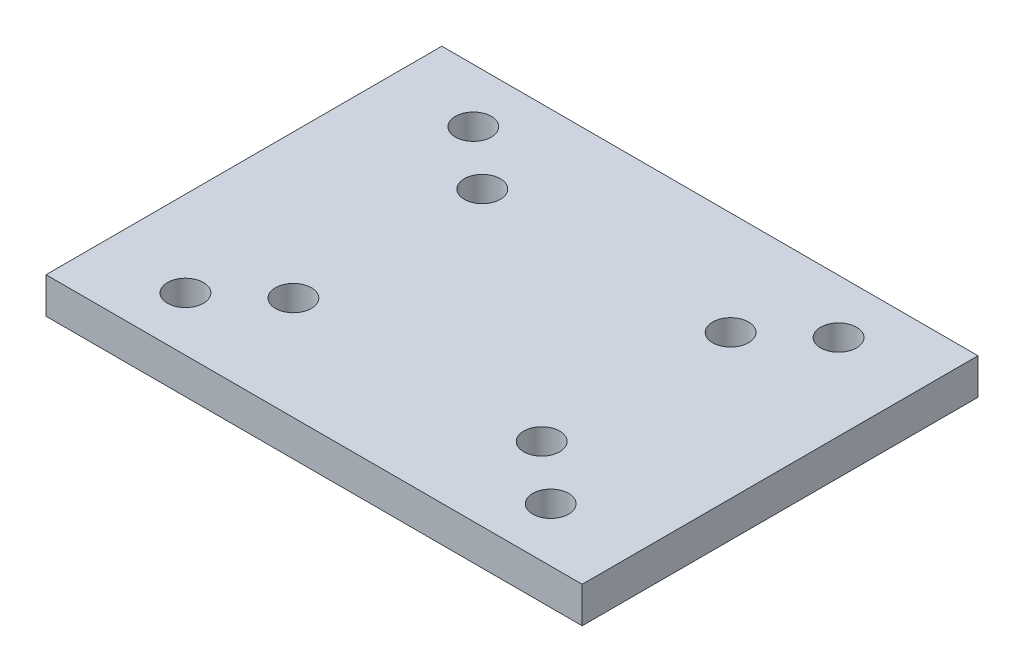
ISO-10303-21;
HEADER;
FILE_DESCRIPTION(('STEP AP214'),'2;1');
FILE_NAME('part.step','',(''),(''),'','','');
FILE_SCHEMA(('AUTOMOTIVE_DESIGN { 1 0 10303 214 1 1 1 1 }'));
ENDSEC;
DATA;
#1=APPLICATION_CONTEXT('core data for automotive mechanical design processes');
#2=APPLICATION_PROTOCOL_DEFINITION('international standard','automotive_design',2000,#1);
#3=PRODUCT_CONTEXT('',#1,'mechanical');
#4=PRODUCT('Part','Part','',(#3));
#5=PRODUCT_RELATED_PRODUCT_CATEGORY('part','',(#4));
#6=PRODUCT_DEFINITION_FORMATION('','',#4);
#7=PRODUCT_DEFINITION_CONTEXT('part definition',#1,'design');
#8=PRODUCT_DEFINITION('design','',#6,#7);
#9=PRODUCT_DEFINITION_SHAPE('','',#8);
#10=(LENGTH_UNIT() NAMED_UNIT(*) SI_UNIT(.MILLI.,.METRE.));
#11=(NAMED_UNIT(*) PLANE_ANGLE_UNIT() SI_UNIT($,.RADIAN.));
#12=(NAMED_UNIT(*) SI_UNIT($,.STERADIAN.) SOLID_ANGLE_UNIT());
#13=UNCERTAINTY_MEASURE_WITH_UNIT(LENGTH_MEASURE(1.E-05),#10,'distance_accuracy_value','');
#14=(GEOMETRIC_REPRESENTATION_CONTEXT(3) GLOBAL_UNCERTAINTY_ASSIGNED_CONTEXT((#13)) GLOBAL_UNIT_ASSIGNED_CONTEXT((#10,
#11,#12)) REPRESENTATION_CONTEXT('',''));
#15=CARTESIAN_POINT('',(0.,0.,0.));
#16=DIRECTION('',(0.,0.,1.));
#17=DIRECTION('',(1.,0.,0.));
#18=AXIS2_PLACEMENT_3D('',#15,#16,#17);
#19=CARTESIAN_POINT('',(6.9,10.,5.25));
#20=DIRECTION('',(0.,-1.,0.));
#21=DIRECTION('',(0.,0.,1.));
#22=AXIS2_PLACEMENT_3D('',#19,#20,#21);
#23=CYLINDRICAL_SURFACE('',#22,1.);
#24=CARTESIAN_POINT('',(6.9,0.,5.25));
#25=DIRECTION('',(0.,1.,0.));
#26=DIRECTION('',(0.,0.,1.));
#27=AXIS2_PLACEMENT_3D('',#24,#25,#26);
#28=CIRCLE('',#27,1.);
#29=CARTESIAN_POINT('',(6.9,0.,6.25));
#30=VERTEX_POINT('',#29);
#31=EDGE_CURVE('E41',#30,#30,#28,.T.);
#32=ORIENTED_EDGE('',*,*,#31,.F.);
#33=EDGE_LOOP('',(#32));
#34=FACE_BOUND('',#33,.T.);
#35=CARTESIAN_POINT('',(6.9,2.,5.25));
#36=DIRECTION('',(0.,1.,0.));
#37=DIRECTION('',(0.,0.,1.));
#38=AXIS2_PLACEMENT_3D('',#35,#36,#37);
#39=CIRCLE('',#38,1.);
#40=CARTESIAN_POINT('',(6.9,2.,6.25));
#41=VERTEX_POINT('',#40);
#42=EDGE_CURVE('E11',#41,#41,#39,.T.);
#43=ORIENTED_EDGE('',*,*,#42,.T.);
#44=EDGE_LOOP('',(#43));
#45=FACE_BOUND('',#44,.T.);
#46=ADVANCED_FACE('F33',(#34,#45),#23,.F.);
#47=CARTESIAN_POINT('',(-6.9,10.,5.25));
#48=DIRECTION('',(0.,-1.,0.));
#49=DIRECTION('',(0.,0.,1.));
#50=AXIS2_PLACEMENT_3D('',#47,#48,#49);
#51=CYLINDRICAL_SURFACE('',#50,1.);
#52=CARTESIAN_POINT('',(-6.9,0.,5.25));
#53=DIRECTION('',(0.,1.,0.));
#54=DIRECTION('',(0.,0.,1.));
#55=AXIS2_PLACEMENT_3D('',#52,#53,#54);
#56=CIRCLE('',#55,1.);
#57=CARTESIAN_POINT('',(-6.9,0.,6.25));
#58=VERTEX_POINT('',#57);
#59=EDGE_CURVE('E111',#58,#58,#56,.T.);
#60=ORIENTED_EDGE('',*,*,#59,.F.);
#61=EDGE_LOOP('',(#60));
#62=FACE_BOUND('',#61,.T.);
#63=CARTESIAN_POINT('',(-6.9,2.,5.25));
#64=DIRECTION('',(0.,1.,0.));
#65=DIRECTION('',(0.,0.,1.));
#66=AXIS2_PLACEMENT_3D('',#63,#64,#65);
#67=CIRCLE('',#66,1.);
#68=CARTESIAN_POINT('',(-6.9,2.,6.25));
#69=VERTEX_POINT('',#68);
#70=EDGE_CURVE('E114',#69,#69,#67,.T.);
#71=ORIENTED_EDGE('',*,*,#70,.T.);
#72=EDGE_LOOP('',(#71));
#73=FACE_BOUND('',#72,.T.);
#74=ADVANCED_FACE('F124',(#62,#73),#51,.F.);
#75=CARTESIAN_POINT('',(0.,2.,0.));
#76=DIRECTION('',(0.,-1.,0.));
#77=DIRECTION('',(0.,0.,-1.));
#78=AXIS2_PLACEMENT_3D('',#75,#76,#77);
#79=PLANE('',#78);
#80=ORIENTED_EDGE('',*,*,#42,.F.);
#81=EDGE_LOOP('',(#80));
#82=FACE_BOUND('',#81,.T.);
#83=ORIENTED_EDGE('',*,*,#70,.F.);
#84=EDGE_LOOP('',(#83));
#85=FACE_BOUND('',#84,.T.);
#86=CARTESIAN_POINT('',(-6.9,2.,-5.25));
#87=DIRECTION('',(0.,-1.,0.));
#88=DIRECTION('',(0.,0.,-1.));
#89=AXIS2_PLACEMENT_3D('',#86,#87,#88);
#90=CIRCLE('',#89,1.);
#91=CARTESIAN_POINT('',(-6.9,2.,-6.25));
#92=VERTEX_POINT('',#91);
#93=EDGE_CURVE('E135',#92,#92,#90,.T.);
#94=ORIENTED_EDGE('',*,*,#93,.T.);
#95=EDGE_LOOP('',(#94));
#96=FACE_BOUND('',#95,.T.);
#97=CARTESIAN_POINT('',(6.9,2.,-5.25));
#98=DIRECTION('',(0.,-1.,0.));
#99=DIRECTION('',(0.,0.,-1.));
#100=AXIS2_PLACEMENT_3D('',#97,#98,#99);
#101=CIRCLE('',#100,1.);
#102=CARTESIAN_POINT('',(6.9,2.,-6.25));
#103=VERTEX_POINT('',#102);
#104=EDGE_CURVE('E138',#103,#103,#101,.T.);
#105=ORIENTED_EDGE('',*,*,#104,.T.);
#106=EDGE_LOOP('',(#105));
#107=FACE_BOUND('',#106,.T.);
#108=DIRECTION('',(0.,0.,-1.));
#109=VECTOR('',#108,1.);
#110=CARTESIAN_POINT('',(14.9,2.,11.));
#111=LINE('',#110,#109);
#112=CARTESIAN_POINT('',(14.9,2.,11.));
#113=VERTEX_POINT('',#112);
#114=CARTESIAN_POINT('',(14.9,2.,-11.));
#115=VERTEX_POINT('',#114);
#116=EDGE_CURVE('E86',#113,#115,#111,.T.);
#117=ORIENTED_EDGE('',*,*,#116,.T.);
#118=DIRECTION('',(-1.,0.,0.));
#119=VECTOR('',#118,1.);
#120=CARTESIAN_POINT('',(-14.9,2.,-11.));
#121=LINE('',#120,#119);
#122=CARTESIAN_POINT('',(-14.9,2.,-11.));
#123=VERTEX_POINT('',#122);
#124=EDGE_CURVE('E80',#115,#123,#121,.T.);
#125=ORIENTED_EDGE('',*,*,#124,.T.);
#126=DIRECTION('',(0.,0.,1.));
#127=VECTOR('',#126,1.);
#128=CARTESIAN_POINT('',(-14.9,2.,11.));
#129=LINE('',#128,#127);
#130=CARTESIAN_POINT('',(-14.9,2.,11.));
#131=VERTEX_POINT('',#130);
#132=EDGE_CURVE('E84',#123,#131,#129,.T.);
#133=ORIENTED_EDGE('',*,*,#132,.T.);
#134=DIRECTION('',(1.,0.,0.));
#135=VECTOR('',#134,1.);
#136=CARTESIAN_POINT('',(-14.9,2.,11.));
#137=LINE('',#136,#135);
#138=EDGE_CURVE('E49',#131,#113,#137,.T.);
#139=ORIENTED_EDGE('',*,*,#138,.T.);
#140=EDGE_LOOP('',(#117,#125,#133,#139));
#141=FACE_BOUND('',#140,.T.);
#142=CARTESIAN_POINT('',(10.15,2.,-8.));
#143=DIRECTION('',(0.,1.,0.));
#144=DIRECTION('',(0.,0.,1.));
#145=AXIS2_PLACEMENT_3D('',#142,#143,#144);
#146=CIRCLE('',#145,1.);
#147=CARTESIAN_POINT('',(10.15,2.,-7.));
#148=VERTEX_POINT('',#147);
#149=EDGE_CURVE('E104',#148,#148,#146,.T.);
#150=ORIENTED_EDGE('',*,*,#149,.F.);
#151=EDGE_LOOP('',(#150));
#152=FACE_BOUND('',#151,.T.);
#153=CARTESIAN_POINT('',(10.15,2.,8.));
#154=DIRECTION('',(0.,1.,0.));
#155=DIRECTION('',(0.,0.,1.));
#156=AXIS2_PLACEMENT_3D('',#153,#154,#155);
#157=CIRCLE('',#156,1.);
#158=CARTESIAN_POINT('',(10.15,2.,9.));
#159=VERTEX_POINT('',#158);
#160=EDGE_CURVE('E159',#159,#159,#157,.T.);
#161=ORIENTED_EDGE('',*,*,#160,.F.);
#162=EDGE_LOOP('',(#161));
#163=FACE_BOUND('',#162,.T.);
#164=CARTESIAN_POINT('',(-10.15,2.,8.));
#165=DIRECTION('',(0.,1.,0.));
#166=DIRECTION('',(0.,0.,1.));
#167=AXIS2_PLACEMENT_3D('',#164,#165,#166);
#168=CIRCLE('',#167,1.);
#169=CARTESIAN_POINT('',(-10.15,2.,9.));
#170=VERTEX_POINT('',#169);
#171=EDGE_CURVE('E153',#170,#170,#168,.T.);
#172=ORIENTED_EDGE('',*,*,#171,.F.);
#173=EDGE_LOOP('',(#172));
#174=FACE_BOUND('',#173,.T.);
#175=CARTESIAN_POINT('',(-10.15,2.,-8.));
#176=DIRECTION('',(0.,1.,0.));
#177=DIRECTION('',(0.,0.,1.));
#178=AXIS2_PLACEMENT_3D('',#175,#176,#177);
#179=CIRCLE('',#178,1.);
#180=CARTESIAN_POINT('',(-10.15,2.,-7.));
#181=VERTEX_POINT('',#180);
#182=EDGE_CURVE('E144',#181,#181,#179,.T.);
#183=ORIENTED_EDGE('',*,*,#182,.F.);
#184=EDGE_LOOP('',(#183));
#185=FACE_BOUND('',#184,.T.);
#186=ADVANCED_FACE('F81',(#82,#85,#96,#107,#141,#152,#163,#174,#185),#79,.F.);
#187=CARTESIAN_POINT('',(0.,0.,0.));
#188=DIRECTION('',(0.,-1.,0.));
#189=DIRECTION('',(0.,0.,-1.));
#190=AXIS2_PLACEMENT_3D('',#187,#188,#189);
#191=PLANE('',#190);
#192=ORIENTED_EDGE('',*,*,#31,.T.);
#193=EDGE_LOOP('',(#192));
#194=FACE_BOUND('',#193,.T.);
#195=ORIENTED_EDGE('',*,*,#59,.T.);
#196=EDGE_LOOP('',(#195));
#197=FACE_BOUND('',#196,.T.);
#198=CARTESIAN_POINT('',(-6.9,0.,-5.25));
#199=DIRECTION('',(0.,-1.,0.));
#200=DIRECTION('',(0.,0.,-1.));
#201=AXIS2_PLACEMENT_3D('',#198,#199,#200);
#202=CIRCLE('',#201,1.);
#203=CARTESIAN_POINT('',(-6.9,0.,-6.25));
#204=VERTEX_POINT('',#203);
#205=EDGE_CURVE('E207',#204,#204,#202,.T.);
#206=ORIENTED_EDGE('',*,*,#205,.F.);
#207=EDGE_LOOP('',(#206));
#208=FACE_BOUND('',#207,.T.);
#209=CARTESIAN_POINT('',(6.9,0.,-5.25));
#210=DIRECTION('',(0.,-1.,0.));
#211=DIRECTION('',(0.,0.,-1.));
#212=AXIS2_PLACEMENT_3D('',#209,#210,#211);
#213=CIRCLE('',#212,1.);
#214=CARTESIAN_POINT('',(6.9,0.,-6.25));
#215=VERTEX_POINT('',#214);
#216=EDGE_CURVE('E141',#215,#215,#213,.T.);
#217=ORIENTED_EDGE('',*,*,#216,.F.);
#218=EDGE_LOOP('',(#217));
#219=FACE_BOUND('',#218,.T.);
#220=CARTESIAN_POINT('',(-10.15,0.,8.));
#221=DIRECTION('',(0.,1.,0.));
#222=DIRECTION('',(0.,0.,1.));
#223=AXIS2_PLACEMENT_3D('',#220,#221,#222);
#224=CIRCLE('',#223,1.);
#225=CARTESIAN_POINT('',(-10.15,0.,9.));
#226=VERTEX_POINT('',#225);
#227=EDGE_CURVE('E151',#226,#226,#224,.T.);
#228=ORIENTED_EDGE('',*,*,#227,.T.);
#229=EDGE_LOOP('',(#228));
#230=FACE_BOUND('',#229,.T.);
#231=CARTESIAN_POINT('',(10.15,0.,-8.));
#232=DIRECTION('',(0.,1.,0.));
#233=DIRECTION('',(0.,0.,1.));
#234=AXIS2_PLACEMENT_3D('',#231,#232,#233);
#235=CIRCLE('',#234,1.);
#236=CARTESIAN_POINT('',(10.15,0.,-7.));
#237=VERTEX_POINT('',#236);
#238=EDGE_CURVE('E162',#237,#237,#235,.T.);
#239=ORIENTED_EDGE('',*,*,#238,.T.);
#240=EDGE_LOOP('',(#239));
#241=FACE_BOUND('',#240,.T.);
#242=DIRECTION('',(0.,0.,-1.));
#243=VECTOR('',#242,1.);
#244=CARTESIAN_POINT('',(14.9,0.,11.));
#245=LINE('',#244,#243);
#246=CARTESIAN_POINT('',(14.9,0.,11.));
#247=VERTEX_POINT('',#246);
#248=CARTESIAN_POINT('',(14.9,0.,-11.));
#249=VERTEX_POINT('',#248);
#250=EDGE_CURVE('E101',#247,#249,#245,.T.);
#251=ORIENTED_EDGE('',*,*,#250,.F.);
#252=DIRECTION('',(1.,0.,0.));
#253=VECTOR('',#252,1.);
#254=CARTESIAN_POINT('',(-14.9,0.,11.));
#255=LINE('',#254,#253);
#256=CARTESIAN_POINT('',(-14.9,0.,11.));
#257=VERTEX_POINT('',#256);
#258=EDGE_CURVE('E72',#257,#247,#255,.T.);
#259=ORIENTED_EDGE('',*,*,#258,.F.);
#260=DIRECTION('',(0.,0.,1.));
#261=VECTOR('',#260,1.);
#262=CARTESIAN_POINT('',(-14.9,0.,11.));
#263=LINE('',#262,#261);
#264=CARTESIAN_POINT('',(-14.9,0.,-11.));
#265=VERTEX_POINT('',#264);
#266=EDGE_CURVE('E66',#265,#257,#263,.T.);
#267=ORIENTED_EDGE('',*,*,#266,.F.);
#268=DIRECTION('',(-1.,0.,0.));
#269=VECTOR('',#268,1.);
#270=CARTESIAN_POINT('',(-14.9,0.,-11.));
#271=LINE('',#270,#269);
#272=EDGE_CURVE('E91',#249,#265,#271,.T.);
#273=ORIENTED_EDGE('',*,*,#272,.F.);
#274=EDGE_LOOP('',(#251,#259,#267,#273));
#275=FACE_BOUND('',#274,.T.);
#276=CARTESIAN_POINT('',(10.15,0.,8.));
#277=DIRECTION('',(0.,1.,0.));
#278=DIRECTION('',(0.,0.,1.));
#279=AXIS2_PLACEMENT_3D('',#276,#277,#278);
#280=CIRCLE('',#279,1.);
#281=CARTESIAN_POINT('',(10.15,0.,9.));
#282=VERTEX_POINT('',#281);
#283=EDGE_CURVE('E156',#282,#282,#280,.T.);
#284=ORIENTED_EDGE('',*,*,#283,.T.);
#285=EDGE_LOOP('',(#284));
#286=FACE_BOUND('',#285,.T.);
#287=CARTESIAN_POINT('',(-10.15,0.,-8.));
#288=DIRECTION('',(0.,1.,0.));
#289=DIRECTION('',(0.,0.,1.));
#290=AXIS2_PLACEMENT_3D('',#287,#288,#289);
#291=CIRCLE('',#290,1.);
#292=CARTESIAN_POINT('',(-10.15,0.,-7.));
#293=VERTEX_POINT('',#292);
#294=EDGE_CURVE('E140',#293,#293,#291,.T.);
#295=ORIENTED_EDGE('',*,*,#294,.T.);
#296=EDGE_LOOP('',(#295));
#297=FACE_BOUND('',#296,.T.);
#298=ADVANCED_FACE('F119',(#194,#197,#208,#219,#230,#241,#275,#286,#297),#191,.T.);
#299=CARTESIAN_POINT('',(14.9,2.,11.));
#300=DIRECTION('',(-1.,0.,0.));
#301=DIRECTION('',(0.,0.,1.));
#302=AXIS2_PLACEMENT_3D('',#299,#300,#301);
#303=PLANE('',#302);
#304=ORIENTED_EDGE('',*,*,#250,.T.);
#305=DIRECTION('',(0.,-1.,0.));
#306=VECTOR('',#305,1.);
#307=CARTESIAN_POINT('',(14.9,2.,-11.));
#308=LINE('',#307,#306);
#309=EDGE_CURVE('E92',#115,#249,#308,.T.);
#310=ORIENTED_EDGE('',*,*,#309,.F.);
#311=ORIENTED_EDGE('',*,*,#116,.F.);
#312=DIRECTION('',(0.,-1.,0.));
#313=VECTOR('',#312,1.);
#314=CARTESIAN_POINT('',(14.9,2.,11.));
#315=LINE('',#314,#313);
#316=EDGE_CURVE('E97',#113,#247,#315,.T.);
#317=ORIENTED_EDGE('',*,*,#316,.T.);
#318=EDGE_LOOP('',(#304,#310,#311,#317));
#319=FACE_BOUND('',#318,.T.);
#320=ADVANCED_FACE('F189',(#319),#303,.F.);
#321=CARTESIAN_POINT('',(-14.9,2.,-11.));
#322=DIRECTION('',(0.,0.,1.));
#323=DIRECTION('',(1.,0.,0.));
#324=AXIS2_PLACEMENT_3D('',#321,#322,#323);
#325=PLANE('',#324);
#326=ORIENTED_EDGE('',*,*,#272,.T.);
#327=DIRECTION('',(0.,-1.,0.));
#328=VECTOR('',#327,1.);
#329=CARTESIAN_POINT('',(-14.9,2.,-11.));
#330=LINE('',#329,#328);
#331=EDGE_CURVE('E89',#123,#265,#330,.T.);
#332=ORIENTED_EDGE('',*,*,#331,.F.);
#333=ORIENTED_EDGE('',*,*,#124,.F.);
#334=ORIENTED_EDGE('',*,*,#309,.T.);
#335=EDGE_LOOP('',(#326,#332,#333,#334));
#336=FACE_BOUND('',#335,.T.);
#337=ADVANCED_FACE('F90',(#336),#325,.F.);
#338=CARTESIAN_POINT('',(-14.9,2.,11.));
#339=DIRECTION('',(1.,0.,0.));
#340=DIRECTION('',(0.,0.,-1.));
#341=AXIS2_PLACEMENT_3D('',#338,#339,#340);
#342=PLANE('',#341);
#343=ORIENTED_EDGE('',*,*,#266,.T.);
#344=DIRECTION('',(0.,-1.,0.));
#345=VECTOR('',#344,1.);
#346=CARTESIAN_POINT('',(-14.9,2.,11.));
#347=LINE('',#346,#345);
#348=EDGE_CURVE('E93',#131,#257,#347,.T.);
#349=ORIENTED_EDGE('',*,*,#348,.F.);
#350=ORIENTED_EDGE('',*,*,#132,.F.);
#351=ORIENTED_EDGE('',*,*,#331,.T.);
#352=EDGE_LOOP('',(#343,#349,#350,#351));
#353=FACE_BOUND('',#352,.T.);
#354=ADVANCED_FACE('F95',(#353),#342,.F.);
#355=CARTESIAN_POINT('',(-14.9,2.,11.));
#356=DIRECTION('',(0.,0.,-1.));
#357=DIRECTION('',(-1.,0.,0.));
#358=AXIS2_PLACEMENT_3D('',#355,#356,#357);
#359=PLANE('',#358);
#360=ORIENTED_EDGE('',*,*,#258,.T.);
#361=ORIENTED_EDGE('',*,*,#316,.F.);
#362=ORIENTED_EDGE('',*,*,#138,.F.);
#363=ORIENTED_EDGE('',*,*,#348,.T.);
#364=EDGE_LOOP('',(#360,#361,#362,#363));
#365=FACE_BOUND('',#364,.T.);
#366=ADVANCED_FACE('F175',(#365),#359,.F.);
#367=CARTESIAN_POINT('',(10.15,2.,-8.));
#368=DIRECTION('',(0.,-1.,0.));
#369=DIRECTION('',(0.,0.,-1.));
#370=AXIS2_PLACEMENT_3D('',#367,#368,#369);
#371=CYLINDRICAL_SURFACE('',#370,1.);
#372=ORIENTED_EDGE('',*,*,#149,.T.);
#373=EDGE_LOOP('',(#372));
#374=FACE_BOUND('',#373,.T.);
#375=ORIENTED_EDGE('',*,*,#238,.F.);
#376=EDGE_LOOP('',(#375));
#377=FACE_BOUND('',#376,.T.);
#378=ADVANCED_FACE('F172',(#374,#377),#371,.F.);
#379=CARTESIAN_POINT('',(10.15,2.,8.));
#380=DIRECTION('',(0.,-1.,0.));
#381=DIRECTION('',(0.,0.,-1.));
#382=AXIS2_PLACEMENT_3D('',#379,#380,#381);
#383=CYLINDRICAL_SURFACE('',#382,1.);
#384=ORIENTED_EDGE('',*,*,#160,.T.);
#385=EDGE_LOOP('',(#384));
#386=FACE_BOUND('',#385,.T.);
#387=ORIENTED_EDGE('',*,*,#283,.F.);
#388=EDGE_LOOP('',(#387));
#389=FACE_BOUND('',#388,.T.);
#390=ADVANCED_FACE('F174',(#386,#389),#383,.F.);
#391=CARTESIAN_POINT('',(-10.15,2.,8.));
#392=DIRECTION('',(0.,-1.,0.));
#393=DIRECTION('',(0.,0.,-1.));
#394=AXIS2_PLACEMENT_3D('',#391,#392,#393);
#395=CYLINDRICAL_SURFACE('',#394,1.);
#396=ORIENTED_EDGE('',*,*,#171,.T.);
#397=EDGE_LOOP('',(#396));
#398=FACE_BOUND('',#397,.T.);
#399=ORIENTED_EDGE('',*,*,#227,.F.);
#400=EDGE_LOOP('',(#399));
#401=FACE_BOUND('',#400,.T.);
#402=ADVANCED_FACE('F182',(#398,#401),#395,.F.);
#403=CARTESIAN_POINT('',(-10.15,2.,-8.));
#404=DIRECTION('',(0.,-1.,0.));
#405=DIRECTION('',(0.,0.,-1.));
#406=AXIS2_PLACEMENT_3D('',#403,#404,#405);
#407=CYLINDRICAL_SURFACE('',#406,1.);
#408=ORIENTED_EDGE('',*,*,#182,.T.);
#409=EDGE_LOOP('',(#408));
#410=FACE_BOUND('',#409,.T.);
#411=ORIENTED_EDGE('',*,*,#294,.F.);
#412=EDGE_LOOP('',(#411));
#413=FACE_BOUND('',#412,.T.);
#414=ADVANCED_FACE('F213',(#410,#413),#407,.F.);
#415=CARTESIAN_POINT('',(6.9,10.,-5.25));
#416=DIRECTION('',(0.,-1.,0.));
#417=DIRECTION('',(0.,0.,-1.));
#418=AXIS2_PLACEMENT_3D('',#415,#416,#417);
#419=CYLINDRICAL_SURFACE('',#418,1.);
#420=ORIENTED_EDGE('',*,*,#216,.T.);
#421=EDGE_LOOP('',(#420));
#422=FACE_BOUND('',#421,.T.);
#423=ORIENTED_EDGE('',*,*,#104,.F.);
#424=EDGE_LOOP('',(#423));
#425=FACE_BOUND('',#424,.T.);
#426=ADVANCED_FACE('F218',(#422,#425),#419,.F.);
#427=CARTESIAN_POINT('',(-6.9,10.,-5.25));
#428=DIRECTION('',(0.,-1.,0.));
#429=DIRECTION('',(0.,0.,-1.));
#430=AXIS2_PLACEMENT_3D('',#427,#428,#429);
#431=CYLINDRICAL_SURFACE('',#430,1.);
#432=ORIENTED_EDGE('',*,*,#205,.T.);
#433=EDGE_LOOP('',(#432));
#434=FACE_BOUND('',#433,.T.);
#435=ORIENTED_EDGE('',*,*,#93,.F.);
#436=EDGE_LOOP('',(#435));
#437=FACE_BOUND('',#436,.T.);
#438=ADVANCED_FACE('F224',(#434,#437),#431,.F.);
#439=CLOSED_SHELL('',(#46,#74,#186,#298,#320,#337,#354,#366,#378,#390,#402,#414,#426,#438));
#440=MANIFOLD_SOLID_BREP('B2',#439);
#441=ADVANCED_BREP_SHAPE_REPRESENTATION('',(#18,#440),#14);
#442=SHAPE_DEFINITION_REPRESENTATION(#9,#441);
ENDSEC;
END-ISO-10303-21;
